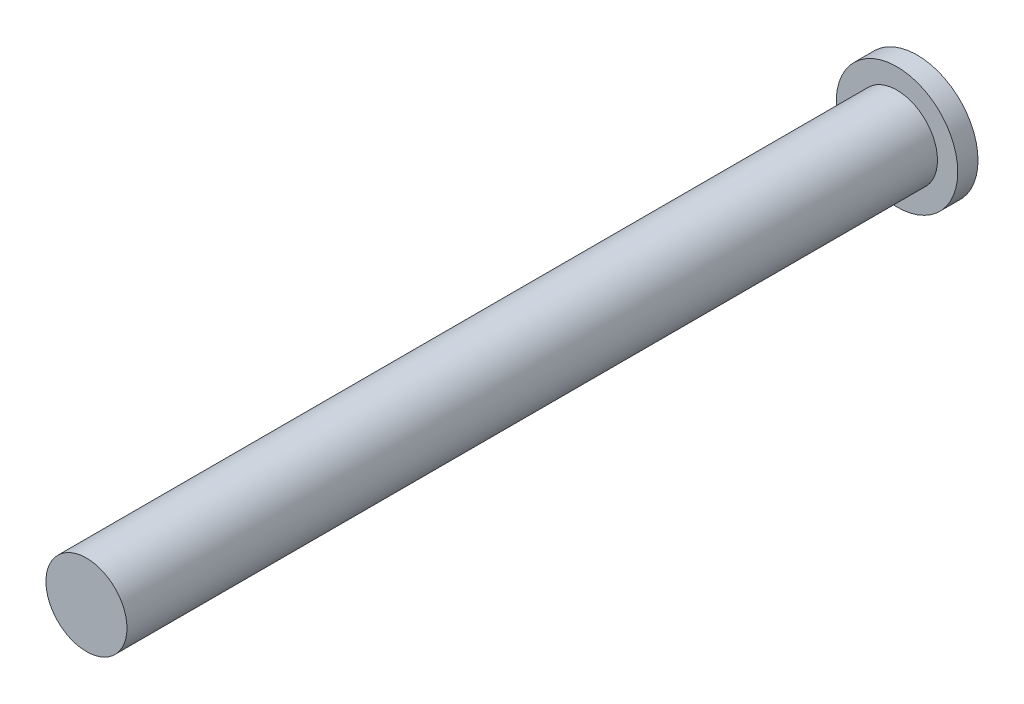
ISO-10303-21;
HEADER;
FILE_DESCRIPTION(('STEP AP214'),'2;1');
FILE_NAME('part.step','',(''),(''),'','','');
FILE_SCHEMA(('AUTOMOTIVE_DESIGN { 1 0 10303 214 1 1 1 1 }'));
ENDSEC;
DATA;
#1=APPLICATION_CONTEXT('core data for automotive mechanical design processes');
#2=APPLICATION_PROTOCOL_DEFINITION('international standard','automotive_design',2000,#1);
#3=PRODUCT_CONTEXT('',#1,'mechanical');
#4=PRODUCT('Part','Part','',(#3));
#5=PRODUCT_RELATED_PRODUCT_CATEGORY('part','',(#4));
#6=PRODUCT_DEFINITION_FORMATION('','',#4);
#7=PRODUCT_DEFINITION_CONTEXT('part definition',#1,'design');
#8=PRODUCT_DEFINITION('design','',#6,#7);
#9=PRODUCT_DEFINITION_SHAPE('','',#8);
#10=(LENGTH_UNIT() NAMED_UNIT(*) SI_UNIT(.MILLI.,.METRE.));
#11=(NAMED_UNIT(*) PLANE_ANGLE_UNIT() SI_UNIT($,.RADIAN.));
#12=(NAMED_UNIT(*) SI_UNIT($,.STERADIAN.) SOLID_ANGLE_UNIT());
#13=UNCERTAINTY_MEASURE_WITH_UNIT(LENGTH_MEASURE(1.E-05),#10,'distance_accuracy_value','');
#14=(GEOMETRIC_REPRESENTATION_CONTEXT(3) GLOBAL_UNCERTAINTY_ASSIGNED_CONTEXT((#13)) GLOBAL_UNIT_ASSIGNED_CONTEXT((#10,
#11,#12)) REPRESENTATION_CONTEXT('',''));
#15=CARTESIAN_POINT('',(0.,0.,0.));
#16=DIRECTION('',(0.,0.,1.));
#17=DIRECTION('',(1.,0.,0.));
#18=AXIS2_PLACEMENT_3D('',#15,#16,#17);
#19=CARTESIAN_POINT('',(0.,0.,40.));
#20=DIRECTION('',(0.,0.,-1.));
#21=DIRECTION('',(-1.,0.,0.));
#22=AXIS2_PLACEMENT_3D('',#19,#20,#21);
#23=CYLINDRICAL_SURFACE('',#22,2.);
#24=CARTESIAN_POINT('',(0.,0.,40.));
#25=DIRECTION('',(0.,0.,1.));
#26=DIRECTION('',(1.,0.,0.));
#27=AXIS2_PLACEMENT_3D('',#24,#25,#26);
#28=CIRCLE('',#27,2.);
#29=CARTESIAN_POINT('',(2.,0.,40.));
#30=VERTEX_POINT('',#29);
#31=EDGE_CURVE('E10',#30,#30,#28,.T.);
#32=ORIENTED_EDGE('',*,*,#31,.F.);
#33=EDGE_LOOP('',(#32));
#34=FACE_BOUND('',#33,.T.);
#35=CARTESIAN_POINT('',(0.,0.,0.));
#36=DIRECTION('',(0.,0.,1.));
#37=DIRECTION('',(1.,0.,0.));
#38=AXIS2_PLACEMENT_3D('',#35,#36,#37);
#39=CIRCLE('',#38,2.);
#40=CARTESIAN_POINT('',(2.,0.,0.));
#41=VERTEX_POINT('',#40);
#42=EDGE_CURVE('E38',#41,#41,#39,.T.);
#43=ORIENTED_EDGE('',*,*,#42,.T.);
#44=EDGE_LOOP('',(#43));
#45=FACE_BOUND('',#44,.T.);
#46=ADVANCED_FACE('F32',(#34,#45),#23,.T.);
#47=CARTESIAN_POINT('',(0.,0.,40.));
#48=DIRECTION('',(0.,0.,1.));
#49=DIRECTION('',(1.,0.,0.));
#50=AXIS2_PLACEMENT_3D('',#47,#48,#49);
#51=PLANE('',#50);
#52=ORIENTED_EDGE('',*,*,#31,.T.);
#53=EDGE_LOOP('',(#52));
#54=FACE_BOUND('',#53,.T.);
#55=ADVANCED_FACE('F66',(#54),#51,.T.);
#56=CARTESIAN_POINT('',(0.,0.,0.));
#57=DIRECTION('',(0.,0.,1.));
#58=DIRECTION('',(1.,0.,0.));
#59=AXIS2_PLACEMENT_3D('',#56,#57,#58);
#60=PLANE('',#59);
#61=CARTESIAN_POINT('',(0.,0.,0.));
#62=DIRECTION('',(0.,0.,1.));
#63=DIRECTION('',(1.,0.,0.));
#64=AXIS2_PLACEMENT_3D('',#61,#62,#63);
#65=CIRCLE('',#64,3.);
#66=CARTESIAN_POINT('',(3.,0.,0.));
#67=VERTEX_POINT('',#66);
#68=EDGE_CURVE('E46',#67,#67,#65,.T.);
#69=ORIENTED_EDGE('',*,*,#68,.T.);
#70=EDGE_LOOP('',(#69));
#71=FACE_BOUND('',#70,.T.);
#72=ORIENTED_EDGE('',*,*,#42,.F.);
#73=EDGE_LOOP('',(#72));
#74=FACE_BOUND('',#73,.T.);
#75=ADVANCED_FACE('F52',(#71,#74),#60,.T.);
#76=CARTESIAN_POINT('',(0.,0.,-1.));
#77=DIRECTION('',(0.,0.,1.));
#78=DIRECTION('',(1.,0.,0.));
#79=AXIS2_PLACEMENT_3D('',#76,#77,#78);
#80=CYLINDRICAL_SURFACE('',#79,3.);
#81=CARTESIAN_POINT('',(0.,0.,-1.));
#82=DIRECTION('',(0.,0.,1.));
#83=DIRECTION('',(1.,0.,0.));
#84=AXIS2_PLACEMENT_3D('',#81,#82,#83);
#85=CIRCLE('',#84,3.);
#86=CARTESIAN_POINT('',(3.,0.,-1.));
#87=VERTEX_POINT('',#86);
#88=EDGE_CURVE('E42',#87,#87,#85,.T.);
#89=ORIENTED_EDGE('',*,*,#88,.T.);
#90=EDGE_LOOP('',(#89));
#91=FACE_BOUND('',#90,.T.);
#92=ORIENTED_EDGE('',*,*,#68,.F.);
#93=EDGE_LOOP('',(#92));
#94=FACE_BOUND('',#93,.T.);
#95=ADVANCED_FACE('F55',(#91,#94),#80,.T.);
#96=CARTESIAN_POINT('',(0.,0.,-1.));
#97=DIRECTION('',(0.,0.,1.));
#98=DIRECTION('',(1.,0.,0.));
#99=AXIS2_PLACEMENT_3D('',#96,#97,#98);
#100=PLANE('',#99);
#101=ORIENTED_EDGE('',*,*,#88,.F.);
#102=EDGE_LOOP('',(#101));
#103=FACE_BOUND('',#102,.T.);
#104=ADVANCED_FACE('F57',(#103),#100,.F.);
#105=CLOSED_SHELL('',(#46,#55,#75,#95,#104));
#106=MANIFOLD_SOLID_BREP('B2',#105);
#107=ADVANCED_BREP_SHAPE_REPRESENTATION('',(#18,#106),#14);
#108=SHAPE_DEFINITION_REPRESENTATION(#9,#107);
ENDSEC;
END-ISO-10303-21;
